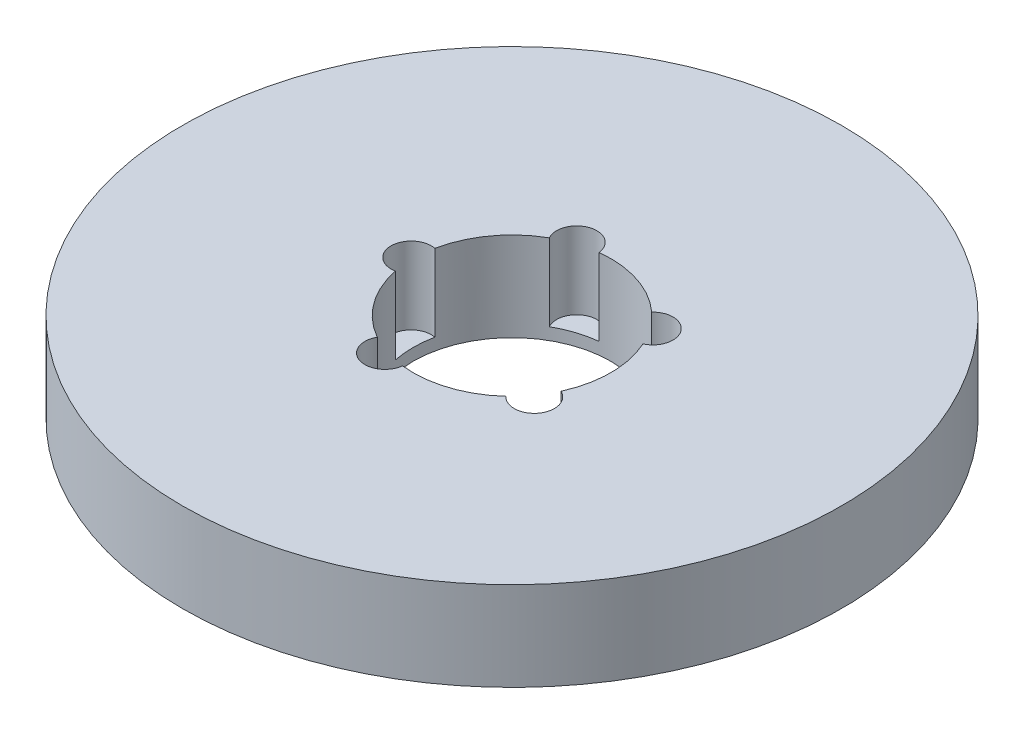
ISO-10303-21;
HEADER;
FILE_DESCRIPTION(('STEP AP214'),'2;1');
FILE_NAME('part.step','',(''),(''),'','','');
FILE_SCHEMA(('AUTOMOTIVE_DESIGN { 1 0 10303 214 1 1 1 1 }'));
ENDSEC;
DATA;
#1=APPLICATION_CONTEXT('core data for automotive mechanical design processes');
#2=APPLICATION_PROTOCOL_DEFINITION('international standard','automotive_design',2000,#1);
#3=PRODUCT_CONTEXT('',#1,'mechanical');
#4=PRODUCT('Part','Part','',(#3));
#5=PRODUCT_RELATED_PRODUCT_CATEGORY('part','',(#4));
#6=PRODUCT_DEFINITION_FORMATION('','',#4);
#7=PRODUCT_DEFINITION_CONTEXT('part definition',#1,'design');
#8=PRODUCT_DEFINITION('design','',#6,#7);
#9=PRODUCT_DEFINITION_SHAPE('','',#8);
#10=(LENGTH_UNIT() NAMED_UNIT(*) SI_UNIT(.MILLI.,.METRE.));
#11=(NAMED_UNIT(*) PLANE_ANGLE_UNIT() SI_UNIT($,.RADIAN.));
#12=(NAMED_UNIT(*) SI_UNIT($,.STERADIAN.) SOLID_ANGLE_UNIT());
#13=UNCERTAINTY_MEASURE_WITH_UNIT(LENGTH_MEASURE(1.E-05),#10,'distance_accuracy_value','');
#14=(GEOMETRIC_REPRESENTATION_CONTEXT(3) GLOBAL_UNCERTAINTY_ASSIGNED_CONTEXT((#13)) GLOBAL_UNIT_ASSIGNED_CONTEXT((#10,
#11,#12)) REPRESENTATION_CONTEXT('',''));
#15=CARTESIAN_POINT('',(0.,0.,0.));
#16=DIRECTION('',(0.,0.,1.));
#17=DIRECTION('',(1.,0.,0.));
#18=AXIS2_PLACEMENT_3D('',#15,#16,#17);
#19=CARTESIAN_POINT('',(0.,27.,0.));
#20=DIRECTION('',(0.,-1.,0.));
#21=DIRECTION('',(0.,0.,-1.));
#22=AXIS2_PLACEMENT_3D('',#19,#20,#21);
#23=CYLINDRICAL_SURFACE('',#22,100.);
#24=CARTESIAN_POINT('',(0.,27.,0.));
#25=DIRECTION('',(0.,1.,0.));
#26=DIRECTION('',(0.,0.,1.));
#27=AXIS2_PLACEMENT_3D('',#24,#25,#26);
#28=CIRCLE('',#27,100.);
#29=CARTESIAN_POINT('',(0.,27.,100.));
#30=VERTEX_POINT('',#29);
#31=EDGE_CURVE('E157',#30,#30,#28,.T.);
#32=ORIENTED_EDGE('',*,*,#31,.F.);
#33=EDGE_LOOP('',(#32));
#34=FACE_BOUND('',#33,.T.);
#35=CARTESIAN_POINT('',(0.,0.,0.));
#36=DIRECTION('',(0.,1.,0.));
#37=DIRECTION('',(0.,0.,1.));
#38=AXIS2_PLACEMENT_3D('',#35,#36,#37);
#39=CIRCLE('',#38,100.);
#40=CARTESIAN_POINT('',(0.,0.,100.));
#41=VERTEX_POINT('',#40);
#42=EDGE_CURVE('E150',#41,#41,#39,.T.);
#43=ORIENTED_EDGE('',*,*,#42,.T.);
#44=EDGE_LOOP('',(#43));
#45=FACE_BOUND('',#44,.T.);
#46=ADVANCED_FACE('F39',(#34,#45),#23,.T.);
#47=CARTESIAN_POINT('',(0.,27.,0.));
#48=DIRECTION('',(0.,1.,0.));
#49=DIRECTION('',(0.,0.,1.));
#50=AXIS2_PLACEMENT_3D('',#47,#48,#49);
#51=PLANE('',#50);
#52=CARTESIAN_POINT('',(-9.4532196802196,27.,-29.0940185831119));
#53=DIRECTION('',(0.,1.,0.));
#54=DIRECTION('',(-0.95105651629515,0.,0.309016994374958));
#55=AXIS2_PLACEMENT_3D('',#52,#53,#54);
#56=CIRCLE('',#55,6.10381536574261);
#57=CARTESIAN_POINT('',(-3.39127166507334,27.,-29.8077049853502));
#58=VERTEX_POINT('',#57);
#59=CARTESIAN_POINT('',(-14.7769329854877,27.,-26.1082793677103));
#60=VERTEX_POINT('',#59);
#61=EDGE_CURVE('E194',#58,#60,#56,.T.);
#62=ORIENTED_EDGE('',*,*,#61,.F.);
#63=CARTESIAN_POINT('',(0.,27.,0.));
#64=DIRECTION('',(0.,1.,0.));
#65=DIRECTION('',(0.,0.,1.));
#66=AXIS2_PLACEMENT_3D('',#63,#64,#65);
#67=CIRCLE('',#66,30.);
#68=CARTESIAN_POINT('',(20.2641258046598,27.,-22.1216004252161));
#69=VERTEX_POINT('',#68);
#70=EDGE_CURVE('E147',#69,#58,#67,.T.);
#71=ORIENTED_EDGE('',*,*,#70,.F.);
#72=CARTESIAN_POINT('',(24.7488504259333,27.,-17.9810923536845));
#73=DIRECTION('',(0.,1.,0.));
#74=DIRECTION('',(-0.58778525229248,0.,-0.809016994374942));
#75=AXIS2_PLACEMENT_3D('',#72,#73,#74);
#76=CIRCLE('',#75,6.10381536574261);
#77=CARTESIAN_POINT('',(27.300851485071,27.,-12.4363784193831));
#78=VERTEX_POINT('',#77);
#79=EDGE_CURVE('E254',#78,#69,#76,.T.);
#80=ORIENTED_EDGE('',*,*,#79,.F.);
#81=CARTESIAN_POINT('',(27.3008514850712,27.,12.4363784193827));
#82=VERTEX_POINT('',#81);
#83=EDGE_CURVE('E144',#82,#78,#67,.T.);
#84=ORIENTED_EDGE('',*,*,#83,.F.);
#85=CARTESIAN_POINT('',(24.7488504259336,27.,17.9810923536841));
#86=DIRECTION('',(0.,1.,0.));
#87=DIRECTION('',(0.587785252292469,0.,-0.809016994374951));
#88=AXIS2_PLACEMENT_3D('',#85,#86,#87);
#89=CIRCLE('',#88,6.10381536574261);
#90=CARTESIAN_POINT('',(20.2641258046601,27.,22.1216004252158));
#91=VERTEX_POINT('',#90);
#92=EDGE_CURVE('E141',#91,#82,#89,.T.);
#93=ORIENTED_EDGE('',*,*,#92,.F.);
#94=CARTESIAN_POINT('',(-3.39127166507292,27.,29.8077049853502));
#95=VERTEX_POINT('',#94);
#96=EDGE_CURVE('E134',#95,#91,#67,.T.);
#97=ORIENTED_EDGE('',*,*,#96,.F.);
#98=CARTESIAN_POINT('',(-9.45321968021919,27.,29.094018583112));
#99=DIRECTION('',(0.,1.,0.));
#100=DIRECTION('',(0.951056516295155,0.,0.309016994374945));
#101=AXIS2_PLACEMENT_3D('',#98,#99,#100);
#102=CIRCLE('',#101,6.10381536574261);
#103=CARTESIAN_POINT('',(-14.7769329854873,27.,26.1082793677105));
#104=VERTEX_POINT('',#103);
#105=EDGE_CURVE('E111',#104,#95,#102,.T.);
#106=ORIENTED_EDGE('',*,*,#105,.F.);
#107=CARTESIAN_POINT('',(-29.3967726391707,27.,5.98579638819327));
#108=VERTEX_POINT('',#107);
#109=EDGE_CURVE('E145',#108,#104,#67,.T.);
#110=ORIENTED_EDGE('',*,*,#109,.F.);
#111=CARTESIAN_POINT('',(-30.5912614914284,27.,0.));
#112=DIRECTION('',(0.,1.,0.));
#113=DIRECTION('',(0.,0.,1.));
#114=AXIS2_PLACEMENT_3D('',#111,#112,#113);
#115=CIRCLE('',#114,6.10381536574261);
#116=CARTESIAN_POINT('',(-29.3967726391707,27.,-5.98579638819327));
#117=VERTEX_POINT('',#116);
#118=EDGE_CURVE('E153',#117,#108,#115,.T.);
#119=ORIENTED_EDGE('',*,*,#118,.F.);
#120=EDGE_CURVE('E146',#60,#117,#67,.T.);
#121=ORIENTED_EDGE('',*,*,#120,.F.);
#122=EDGE_LOOP('',(#62,#71,#80,#84,#93,#97,#106,#110,#119,#121));
#123=FACE_BOUND('',#122,.T.);
#124=ORIENTED_EDGE('',*,*,#31,.T.);
#125=EDGE_LOOP('',(#124));
#126=FACE_BOUND('',#125,.T.);
#127=ADVANCED_FACE('F139',(#123,#126),#51,.T.);
#128=CARTESIAN_POINT('',(0.,0.,0.));
#129=DIRECTION('',(0.,1.,0.));
#130=DIRECTION('',(0.,0.,1.));
#131=AXIS2_PLACEMENT_3D('',#128,#129,#130);
#132=PLANE('',#131);
#133=CARTESIAN_POINT('',(0.,0.,0.));
#134=DIRECTION('',(0.,1.,0.));
#135=DIRECTION('',(0.,0.,1.));
#136=AXIS2_PLACEMENT_3D('',#133,#134,#135);
#137=CIRCLE('',#136,30.);
#138=CARTESIAN_POINT('',(0.,0.,30.));
#139=VERTEX_POINT('',#138);
#140=EDGE_CURVE('E154',#139,#139,#137,.T.);
#141=ORIENTED_EDGE('',*,*,#140,.T.);
#142=EDGE_LOOP('',(#141));
#143=FACE_BOUND('',#142,.T.);
#144=ORIENTED_EDGE('',*,*,#42,.F.);
#145=EDGE_LOOP('',(#144));
#146=FACE_BOUND('',#145,.T.);
#147=ADVANCED_FACE('F213',(#143,#146),#132,.F.);
#148=CARTESIAN_POINT('',(0.,27.,0.));
#149=DIRECTION('',(0.,-1.,0.));
#150=DIRECTION('',(0.,0.,-1.));
#151=AXIS2_PLACEMENT_3D('',#148,#149,#150);
#152=CYLINDRICAL_SURFACE('',#151,30.);
#153=DIRECTION('',(0.,1.,0.));
#154=VECTOR('',#153,1.);
#155=CARTESIAN_POINT('',(-3.39127166507334,15.3223784213829,-29.8077049853502));
#156=LINE('',#155,#154);
#157=CARTESIAN_POINT('',(-3.39127166507334,3.64475684276583,-29.8077049853502));
#158=VERTEX_POINT('',#157);
#159=EDGE_CURVE('E11',#158,#58,#156,.T.);
#160=ORIENTED_EDGE('',*,*,#159,.F.);
#161=CARTESIAN_POINT('',(0.,3.64475684276583,0.));
#162=DIRECTION('',(0.,1.,0.));
#163=DIRECTION('',(0.,0.,1.));
#164=AXIS2_PLACEMENT_3D('',#161,#162,#163);
#165=CIRCLE('',#164,30.);
#166=CARTESIAN_POINT('',(-14.7769329854877,3.64475684276583,-26.1082793677103));
#167=VERTEX_POINT('',#166);
#168=EDGE_CURVE('E189',#158,#167,#165,.T.);
#169=ORIENTED_EDGE('',*,*,#168,.T.);
#170=DIRECTION('',(0.,1.,0.));
#171=VECTOR('',#170,1.);
#172=CARTESIAN_POINT('',(-14.7769329854877,15.3223784213829,-26.1082793677103));
#173=LINE('',#172,#171);
#174=EDGE_CURVE('E46',#60,#167,#173,.F.);
#175=ORIENTED_EDGE('',*,*,#174,.F.);
#176=ORIENTED_EDGE('',*,*,#120,.T.);
#177=DIRECTION('',(0.,1.,0.));
#178=VECTOR('',#177,1.);
#179=CARTESIAN_POINT('',(-29.3967726391707,15.3223784213829,-5.98579638819327));
#180=LINE('',#179,#178);
#181=CARTESIAN_POINT('',(-29.3967726391707,3.64475684276583,-5.98579638819327));
#182=VERTEX_POINT('',#181);
#183=EDGE_CURVE('E168',#182,#117,#180,.T.);
#184=ORIENTED_EDGE('',*,*,#183,.F.);
#185=CARTESIAN_POINT('',(0.,3.64475684276583,0.));
#186=DIRECTION('',(0.,1.,0.));
#187=DIRECTION('',(0.,0.,1.));
#188=AXIS2_PLACEMENT_3D('',#185,#186,#187);
#189=CIRCLE('',#188,30.);
#190=CARTESIAN_POINT('',(-29.3967726391707,3.64475684276583,5.98579638819327));
#191=VERTEX_POINT('',#190);
#192=EDGE_CURVE('E165',#182,#191,#189,.T.);
#193=ORIENTED_EDGE('',*,*,#192,.T.);
#194=DIRECTION('',(0.,1.,0.));
#195=VECTOR('',#194,1.);
#196=CARTESIAN_POINT('',(-29.3967726391707,15.3223784213829,5.98579638819327));
#197=LINE('',#196,#195);
#198=EDGE_CURVE('E170',#108,#191,#197,.F.);
#199=ORIENTED_EDGE('',*,*,#198,.F.);
#200=ORIENTED_EDGE('',*,*,#109,.T.);
#201=DIRECTION('',(0.,1.,0.));
#202=VECTOR('',#201,1.);
#203=CARTESIAN_POINT('',(-14.7769329854873,15.3223784213829,26.1082793677105));
#204=LINE('',#203,#202);
#205=CARTESIAN_POINT('',(-14.7769329854873,3.64475684276583,26.1082793677105));
#206=VERTEX_POINT('',#205);
#207=EDGE_CURVE('E121',#206,#104,#204,.T.);
#208=ORIENTED_EDGE('',*,*,#207,.F.);
#209=CARTESIAN_POINT('',(0.,3.64475684276583,0.));
#210=DIRECTION('',(0.,1.,0.));
#211=DIRECTION('',(0.,0.,1.));
#212=AXIS2_PLACEMENT_3D('',#209,#210,#211);
#213=CIRCLE('',#212,30.);
#214=CARTESIAN_POINT('',(-3.39127166507292,3.64475684276583,29.8077049853502));
#215=VERTEX_POINT('',#214);
#216=EDGE_CURVE('E136',#206,#215,#213,.T.);
#217=ORIENTED_EDGE('',*,*,#216,.T.);
#218=DIRECTION('',(0.,1.,0.));
#219=VECTOR('',#218,1.);
#220=CARTESIAN_POINT('',(-3.39127166507292,15.3223784213829,29.8077049853502));
#221=LINE('',#220,#219);
#222=EDGE_CURVE('E117',#95,#215,#221,.F.);
#223=ORIENTED_EDGE('',*,*,#222,.F.);
#224=ORIENTED_EDGE('',*,*,#96,.T.);
#225=DIRECTION('',(0.,1.,0.));
#226=VECTOR('',#225,1.);
#227=CARTESIAN_POINT('',(20.2641258046601,15.3223784213829,22.1216004252158));
#228=LINE('',#227,#226);
#229=CARTESIAN_POINT('',(20.2641258046601,3.64475684276583,22.1216004252158));
#230=VERTEX_POINT('',#229);
#231=EDGE_CURVE('E182',#230,#91,#228,.T.);
#232=ORIENTED_EDGE('',*,*,#231,.F.);
#233=CARTESIAN_POINT('',(0.,3.64475684276583,0.));
#234=DIRECTION('',(0.,1.,0.));
#235=DIRECTION('',(0.,0.,1.));
#236=AXIS2_PLACEMENT_3D('',#233,#234,#235);
#237=CIRCLE('',#236,30.);
#238=CARTESIAN_POINT('',(27.3008514850712,3.64475684276583,12.4363784193827));
#239=VERTEX_POINT('',#238);
#240=EDGE_CURVE('E174',#230,#239,#237,.T.);
#241=ORIENTED_EDGE('',*,*,#240,.T.);
#242=DIRECTION('',(0.,1.,0.));
#243=VECTOR('',#242,1.);
#244=CARTESIAN_POINT('',(27.3008514850712,15.3223784213829,12.4363784193827));
#245=LINE('',#244,#243);
#246=EDGE_CURVE('E177',#82,#239,#245,.F.);
#247=ORIENTED_EDGE('',*,*,#246,.F.);
#248=ORIENTED_EDGE('',*,*,#83,.T.);
#249=DIRECTION('',(0.,1.,0.));
#250=VECTOR('',#249,1.);
#251=CARTESIAN_POINT('',(27.300851485071,15.3223784213829,-12.4363784193831));
#252=LINE('',#251,#250);
#253=CARTESIAN_POINT('',(27.300851485071,3.64475684276583,-12.4363784193831));
#254=VERTEX_POINT('',#253);
#255=EDGE_CURVE('E187',#254,#78,#252,.T.);
#256=ORIENTED_EDGE('',*,*,#255,.F.);
#257=CARTESIAN_POINT('',(0.,3.64475684276583,0.));
#258=DIRECTION('',(0.,1.,0.));
#259=DIRECTION('',(0.,0.,1.));
#260=AXIS2_PLACEMENT_3D('',#257,#258,#259);
#261=CIRCLE('',#260,30.);
#262=CARTESIAN_POINT('',(20.2641258046598,3.64475684276583,-22.1216004252161));
#263=VERTEX_POINT('',#262);
#264=EDGE_CURVE('E181',#254,#263,#261,.T.);
#265=ORIENTED_EDGE('',*,*,#264,.T.);
#266=DIRECTION('',(0.,1.,0.));
#267=VECTOR('',#266,1.);
#268=CARTESIAN_POINT('',(20.2641258046598,15.3223784213829,-22.1216004252161));
#269=LINE('',#268,#267);
#270=EDGE_CURVE('E186',#69,#263,#269,.F.);
#271=ORIENTED_EDGE('',*,*,#270,.F.);
#272=ORIENTED_EDGE('',*,*,#70,.T.);
#273=EDGE_LOOP('',(#160,#169,#175,#176,#184,#193,#199,#200,#208,#217,#223,#224,#232,#241,#247,
#248,#256,#265,#271,#272));
#274=FACE_BOUND('',#273,.T.);
#275=ORIENTED_EDGE('',*,*,#140,.F.);
#276=EDGE_LOOP('',(#275));
#277=FACE_BOUND('',#276,.T.);
#278=ADVANCED_FACE('F135',(#274,#277),#152,.F.);
#279=CARTESIAN_POINT('',(-30.5912614914284,3.64475684276583,0.));
#280=DIRECTION('',(0.,1.,0.));
#281=DIRECTION('',(0.,0.,1.));
#282=AXIS2_PLACEMENT_3D('',#279,#280,#281);
#283=CYLINDRICAL_SURFACE('',#282,6.10381536574261);
#284=ORIENTED_EDGE('',*,*,#183,.T.);
#285=ORIENTED_EDGE('',*,*,#118,.T.);
#286=ORIENTED_EDGE('',*,*,#198,.T.);
#287=CARTESIAN_POINT('',(-30.5912614914284,3.64475684276583,0.));
#288=DIRECTION('',(0.,1.,0.));
#289=DIRECTION('',(0.,0.,1.));
#290=AXIS2_PLACEMENT_3D('',#287,#288,#289);
#291=CIRCLE('',#290,6.10381536574261);
#292=EDGE_CURVE('E158',#182,#191,#291,.T.);
#293=ORIENTED_EDGE('',*,*,#292,.F.);
#294=EDGE_LOOP('',(#284,#285,#286,#293));
#295=FACE_BOUND('',#294,.T.);
#296=ADVANCED_FACE('F221',(#295),#283,.F.);
#297=CARTESIAN_POINT('',(-30.5912614914284,3.64475684276583,0.));
#298=DIRECTION('',(0.,1.,0.));
#299=DIRECTION('',(0.,0.,1.));
#300=AXIS2_PLACEMENT_3D('',#297,#298,#299);
#301=PLANE('',#300);
#302=ORIENTED_EDGE('',*,*,#292,.T.);
#303=ORIENTED_EDGE('',*,*,#192,.F.);
#304=EDGE_LOOP('',(#302,#303));
#305=FACE_BOUND('',#304,.T.);
#306=ADVANCED_FACE('F227',(#305),#301,.T.);
#307=CARTESIAN_POINT('',(-9.45321968021919,3.64475684276583,29.094018583112));
#308=DIRECTION('',(0.,1.,0.));
#309=DIRECTION('',(0.,0.,1.));
#310=AXIS2_PLACEMENT_3D('',#307,#308,#309);
#311=CYLINDRICAL_SURFACE('',#310,6.10381536574261);
#312=ORIENTED_EDGE('',*,*,#207,.T.);
#313=ORIENTED_EDGE('',*,*,#105,.T.);
#314=ORIENTED_EDGE('',*,*,#222,.T.);
#315=CARTESIAN_POINT('',(-9.45321968021919,3.64475684276583,29.094018583112));
#316=DIRECTION('',(0.,1.,0.));
#317=DIRECTION('',(0.951056516295155,0.,0.309016994374945));
#318=AXIS2_PLACEMENT_3D('',#315,#316,#317);
#319=CIRCLE('',#318,6.10381536574261);
#320=EDGE_CURVE('E127',#206,#215,#319,.T.);
#321=ORIENTED_EDGE('',*,*,#320,.F.);
#322=EDGE_LOOP('',(#312,#313,#314,#321));
#323=FACE_BOUND('',#322,.T.);
#324=ADVANCED_FACE('F116',(#323),#311,.F.);
#325=CARTESIAN_POINT('',(-9.45321968021919,3.64475684276583,29.094018583112));
#326=DIRECTION('',(0.,1.,0.));
#327=DIRECTION('',(0.951056516295155,0.,0.309016994374945));
#328=AXIS2_PLACEMENT_3D('',#325,#326,#327);
#329=PLANE('',#328);
#330=ORIENTED_EDGE('',*,*,#320,.T.);
#331=ORIENTED_EDGE('',*,*,#216,.F.);
#332=EDGE_LOOP('',(#330,#331));
#333=FACE_BOUND('',#332,.T.);
#334=ADVANCED_FACE('F234',(#333),#329,.T.);
#335=CARTESIAN_POINT('',(24.7488504259336,3.64475684276583,17.9810923536841));
#336=DIRECTION('',(0.,1.,0.));
#337=DIRECTION('',(0.,0.,1.));
#338=AXIS2_PLACEMENT_3D('',#335,#336,#337);
#339=CYLINDRICAL_SURFACE('',#338,6.10381536574261);
#340=ORIENTED_EDGE('',*,*,#231,.T.);
#341=ORIENTED_EDGE('',*,*,#92,.T.);
#342=ORIENTED_EDGE('',*,*,#246,.T.);
#343=CARTESIAN_POINT('',(24.7488504259336,3.64475684276583,17.9810923536841));
#344=DIRECTION('',(0.,1.,0.));
#345=DIRECTION('',(0.587785252292469,0.,-0.809016994374951));
#346=AXIS2_PLACEMENT_3D('',#343,#344,#345);
#347=CIRCLE('',#346,6.10381536574261);
#348=EDGE_CURVE('E130',#230,#239,#347,.T.);
#349=ORIENTED_EDGE('',*,*,#348,.F.);
#350=EDGE_LOOP('',(#340,#341,#342,#349));
#351=FACE_BOUND('',#350,.T.);
#352=ADVANCED_FACE('F240',(#351),#339,.F.);
#353=CARTESIAN_POINT('',(24.7488504259336,3.64475684276583,17.9810923536841));
#354=DIRECTION('',(0.,1.,0.));
#355=DIRECTION('',(0.587785252292469,0.,-0.809016994374951));
#356=AXIS2_PLACEMENT_3D('',#353,#354,#355);
#357=PLANE('',#356);
#358=ORIENTED_EDGE('',*,*,#348,.T.);
#359=ORIENTED_EDGE('',*,*,#240,.F.);
#360=EDGE_LOOP('',(#358,#359));
#361=FACE_BOUND('',#360,.T.);
#362=ADVANCED_FACE('F245',(#361),#357,.T.);
#363=CARTESIAN_POINT('',(24.7488504259333,3.64475684276583,-17.9810923536845));
#364=DIRECTION('',(0.,1.,0.));
#365=DIRECTION('',(0.,0.,1.));
#366=AXIS2_PLACEMENT_3D('',#363,#364,#365);
#367=CYLINDRICAL_SURFACE('',#366,6.10381536574261);
#368=ORIENTED_EDGE('',*,*,#255,.T.);
#369=ORIENTED_EDGE('',*,*,#79,.T.);
#370=ORIENTED_EDGE('',*,*,#270,.T.);
#371=CARTESIAN_POINT('',(24.7488504259333,3.64475684276583,-17.9810923536845));
#372=DIRECTION('',(0.,1.,0.));
#373=DIRECTION('',(-0.58778525229248,0.,-0.809016994374942));
#374=AXIS2_PLACEMENT_3D('',#371,#372,#373);
#375=CIRCLE('',#374,6.10381536574261);
#376=EDGE_CURVE('E56',#254,#263,#375,.T.);
#377=ORIENTED_EDGE('',*,*,#376,.F.);
#378=EDGE_LOOP('',(#368,#369,#370,#377));
#379=FACE_BOUND('',#378,.T.);
#380=ADVANCED_FACE('F266',(#379),#367,.F.);
#381=CARTESIAN_POINT('',(24.7488504259333,3.64475684276583,-17.9810923536845));
#382=DIRECTION('',(0.,1.,0.));
#383=DIRECTION('',(-0.58778525229248,0.,-0.809016994374942));
#384=AXIS2_PLACEMENT_3D('',#381,#382,#383);
#385=PLANE('',#384);
#386=ORIENTED_EDGE('',*,*,#376,.T.);
#387=ORIENTED_EDGE('',*,*,#264,.F.);
#388=EDGE_LOOP('',(#386,#387));
#389=FACE_BOUND('',#388,.T.);
#390=ADVANCED_FACE('F204',(#389),#385,.T.);
#391=CARTESIAN_POINT('',(-9.4532196802196,3.64475684276583,-29.0940185831119));
#392=DIRECTION('',(0.,1.,0.));
#393=DIRECTION('',(0.,0.,1.));
#394=AXIS2_PLACEMENT_3D('',#391,#392,#393);
#395=CYLINDRICAL_SURFACE('',#394,6.10381536574261);
#396=ORIENTED_EDGE('',*,*,#159,.T.);
#397=ORIENTED_EDGE('',*,*,#61,.T.);
#398=ORIENTED_EDGE('',*,*,#174,.T.);
#399=CARTESIAN_POINT('',(-9.4532196802196,3.64475684276583,-29.0940185831119));
#400=DIRECTION('',(0.,1.,0.));
#401=DIRECTION('',(-0.95105651629515,0.,0.309016994374958));
#402=AXIS2_PLACEMENT_3D('',#399,#400,#401);
#403=CIRCLE('',#402,6.10381536574261);
#404=EDGE_CURVE('E55',#158,#167,#403,.T.);
#405=ORIENTED_EDGE('',*,*,#404,.F.);
#406=EDGE_LOOP('',(#396,#397,#398,#405));
#407=FACE_BOUND('',#406,.T.);
#408=ADVANCED_FACE('F193',(#407),#395,.F.);
#409=CARTESIAN_POINT('',(-9.4532196802196,3.64475684276583,-29.0940185831119));
#410=DIRECTION('',(0.,1.,0.));
#411=DIRECTION('',(-0.95105651629515,0.,0.309016994374958));
#412=AXIS2_PLACEMENT_3D('',#409,#410,#411);
#413=PLANE('',#412);
#414=ORIENTED_EDGE('',*,*,#404,.T.);
#415=ORIENTED_EDGE('',*,*,#168,.F.);
#416=EDGE_LOOP('',(#414,#415));
#417=FACE_BOUND('',#416,.T.);
#418=ADVANCED_FACE('F196',(#417),#413,.T.);
#419=CLOSED_SHELL('',(#46,#127,#147,#278,#296,#306,#324,#334,#352,#362,#380,#390,#408,#418));
#420=MANIFOLD_SOLID_BREP('B2',#419);
#421=ADVANCED_BREP_SHAPE_REPRESENTATION('',(#18,#420),#14);
#422=SHAPE_DEFINITION_REPRESENTATION(#9,#421);
ENDSEC;
END-ISO-10303-21;
